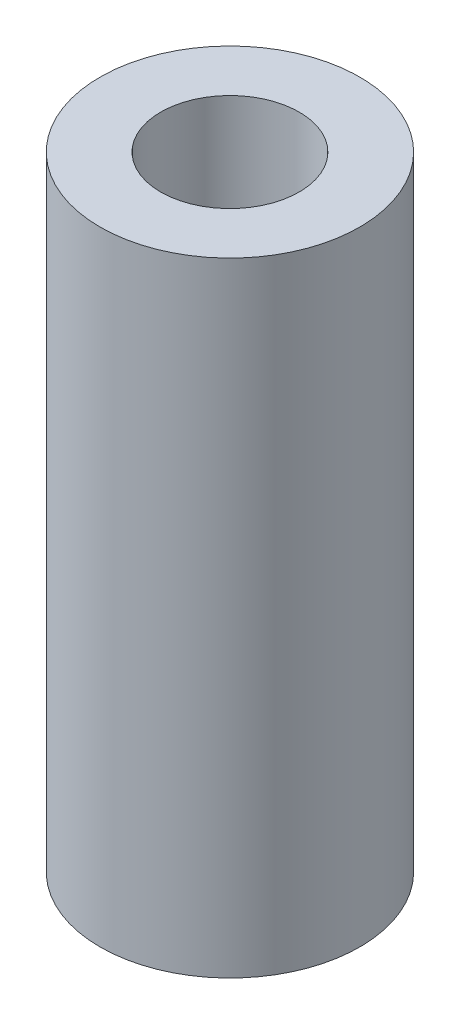
ISO-10303-21;
HEADER;
FILE_DESCRIPTION(('STEP AP214'),'2;1');
FILE_NAME('part.step','',(''),(''),'','','');
FILE_SCHEMA(('AUTOMOTIVE_DESIGN { 1 0 10303 214 1 1 1 1 }'));
ENDSEC;
DATA;
#1=APPLICATION_CONTEXT('core data for automotive mechanical design processes');
#2=APPLICATION_PROTOCOL_DEFINITION('international standard','automotive_design',2000,#1);
#3=PRODUCT_CONTEXT('',#1,'mechanical');
#4=PRODUCT('Part','Part','',(#3));
#5=PRODUCT_RELATED_PRODUCT_CATEGORY('part','',(#4));
#6=PRODUCT_DEFINITION_FORMATION('','',#4);
#7=PRODUCT_DEFINITION_CONTEXT('part definition',#1,'design');
#8=PRODUCT_DEFINITION('design','',#6,#7);
#9=PRODUCT_DEFINITION_SHAPE('','',#8);
#10=(LENGTH_UNIT() NAMED_UNIT(*) SI_UNIT(.MILLI.,.METRE.));
#11=(NAMED_UNIT(*) PLANE_ANGLE_UNIT() SI_UNIT($,.RADIAN.));
#12=(NAMED_UNIT(*) SI_UNIT($,.STERADIAN.) SOLID_ANGLE_UNIT());
#13=UNCERTAINTY_MEASURE_WITH_UNIT(LENGTH_MEASURE(1.E-05),#10,'distance_accuracy_value','');
#14=(GEOMETRIC_REPRESENTATION_CONTEXT(3) GLOBAL_UNCERTAINTY_ASSIGNED_CONTEXT((#13)) GLOBAL_UNIT_ASSIGNED_CONTEXT((#10,
#11,#12)) REPRESENTATION_CONTEXT('',''));
#15=CARTESIAN_POINT('',(0.,0.,0.));
#16=DIRECTION('',(0.,0.,1.));
#17=DIRECTION('',(1.,0.,0.));
#18=AXIS2_PLACEMENT_3D('',#15,#16,#17);
#19=CARTESIAN_POINT('',(0.,36.,0.));
#20=DIRECTION('',(0.,1.,0.));
#21=DIRECTION('',(0.,0.,1.));
#22=AXIS2_PLACEMENT_3D('',#19,#20,#21);
#23=PLANE('',#22);
#24=CARTESIAN_POINT('',(0.,36.,0.));
#25=DIRECTION('',(0.,1.,0.));
#26=DIRECTION('',(0.,0.,1.));
#27=AXIS2_PLACEMENT_3D('',#24,#25,#26);
#28=CIRCLE('',#27,7.5);
#29=CARTESIAN_POINT('',(0.,36.,7.5));
#30=VERTEX_POINT('',#29);
#31=EDGE_CURVE('E10',#30,#30,#28,.T.);
#32=ORIENTED_EDGE('',*,*,#31,.T.);
#33=EDGE_LOOP('',(#32));
#34=FACE_BOUND('',#33,.T.);
#35=CARTESIAN_POINT('',(0.,36.,0.));
#36=DIRECTION('',(0.,1.,0.));
#37=DIRECTION('',(0.,0.,1.));
#38=AXIS2_PLACEMENT_3D('',#35,#36,#37);
#39=CIRCLE('',#38,4.);
#40=CARTESIAN_POINT('',(0.,36.,4.));
#41=VERTEX_POINT('',#40);
#42=EDGE_CURVE('E40',#41,#41,#39,.T.);
#43=ORIENTED_EDGE('',*,*,#42,.F.);
#44=EDGE_LOOP('',(#43));
#45=FACE_BOUND('',#44,.T.);
#46=ADVANCED_FACE('F29',(#34,#45),#23,.T.);
#47=CARTESIAN_POINT('',(0.,0.,0.));
#48=DIRECTION('',(0.,1.,0.));
#49=DIRECTION('',(0.,0.,1.));
#50=AXIS2_PLACEMENT_3D('',#47,#48,#49);
#51=PLANE('',#50);
#52=CARTESIAN_POINT('',(0.,0.,0.));
#53=DIRECTION('',(0.,1.,0.));
#54=DIRECTION('',(0.,0.,1.));
#55=AXIS2_PLACEMENT_3D('',#52,#53,#54);
#56=CIRCLE('',#55,7.5);
#57=CARTESIAN_POINT('',(0.,0.,7.5));
#58=VERTEX_POINT('',#57);
#59=EDGE_CURVE('E33',#58,#58,#56,.T.);
#60=ORIENTED_EDGE('',*,*,#59,.F.);
#61=EDGE_LOOP('',(#60));
#62=FACE_BOUND('',#61,.T.);
#63=CARTESIAN_POINT('',(0.,0.,0.));
#64=DIRECTION('',(0.,1.,0.));
#65=DIRECTION('',(0.,0.,1.));
#66=AXIS2_PLACEMENT_3D('',#63,#64,#65);
#67=CIRCLE('',#66,4.);
#68=CARTESIAN_POINT('',(0.,0.,4.));
#69=VERTEX_POINT('',#68);
#70=EDGE_CURVE('E42',#69,#69,#67,.T.);
#71=ORIENTED_EDGE('',*,*,#70,.T.);
#72=EDGE_LOOP('',(#71));
#73=FACE_BOUND('',#72,.T.);
#74=ADVANCED_FACE('F52',(#62,#73),#51,.F.);
#75=CARTESIAN_POINT('',(0.,36.,0.));
#76=DIRECTION('',(0.,-1.,0.));
#77=DIRECTION('',(0.,0.,-1.));
#78=AXIS2_PLACEMENT_3D('',#75,#76,#77);
#79=CYLINDRICAL_SURFACE('',#78,7.5);
#80=ORIENTED_EDGE('',*,*,#31,.F.);
#81=EDGE_LOOP('',(#80));
#82=FACE_BOUND('',#81,.T.);
#83=ORIENTED_EDGE('',*,*,#59,.T.);
#84=EDGE_LOOP('',(#83));
#85=FACE_BOUND('',#84,.T.);
#86=ADVANCED_FACE('F31',(#82,#85),#79,.T.);
#87=CARTESIAN_POINT('',(0.,36.,0.));
#88=DIRECTION('',(0.,-1.,0.));
#89=DIRECTION('',(0.,0.,-1.));
#90=AXIS2_PLACEMENT_3D('',#87,#88,#89);
#91=CYLINDRICAL_SURFACE('',#90,4.);
#92=ORIENTED_EDGE('',*,*,#42,.T.);
#93=EDGE_LOOP('',(#92));
#94=FACE_BOUND('',#93,.T.);
#95=ORIENTED_EDGE('',*,*,#70,.F.);
#96=EDGE_LOOP('',(#95));
#97=FACE_BOUND('',#96,.T.);
#98=ADVANCED_FACE('F48',(#94,#97),#91,.F.);
#99=CLOSED_SHELL('',(#46,#74,#86,#98));
#100=MANIFOLD_SOLID_BREP('B2',#99);
#101=ADVANCED_BREP_SHAPE_REPRESENTATION('',(#18,#100),#14);
#102=SHAPE_DEFINITION_REPRESENTATION(#9,#101);
ENDSEC;
END-ISO-10303-21;
